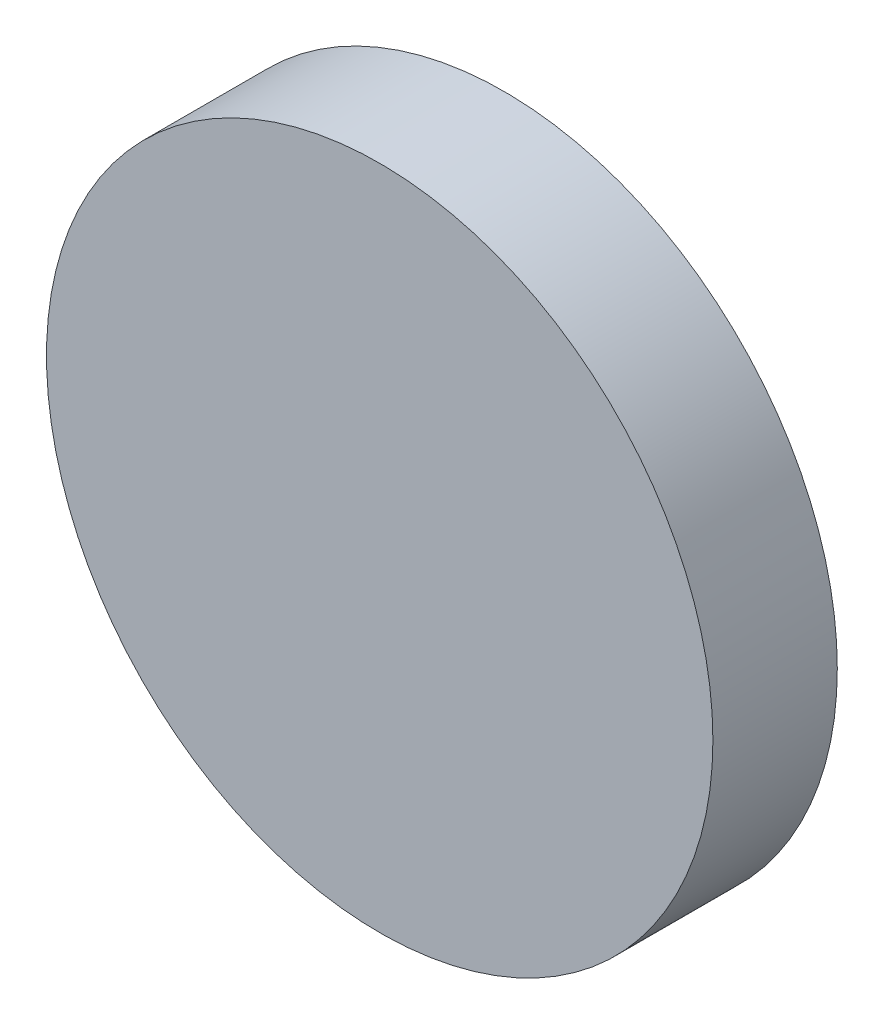
ISO-10303-21;
HEADER;
FILE_DESCRIPTION(('STEP AP214'),'2;1');
FILE_NAME('part.step','',(''),(''),'','','');
FILE_SCHEMA(('AUTOMOTIVE_DESIGN { 1 0 10303 214 1 1 1 1 }'));
ENDSEC;
DATA;
#1=APPLICATION_CONTEXT('core data for automotive mechanical design processes');
#2=APPLICATION_PROTOCOL_DEFINITION('international standard','automotive_design',2000,#1);
#3=PRODUCT_CONTEXT('',#1,'mechanical');
#4=PRODUCT('Part','Part','',(#3));
#5=PRODUCT_RELATED_PRODUCT_CATEGORY('part','',(#4));
#6=PRODUCT_DEFINITION_FORMATION('','',#4);
#7=PRODUCT_DEFINITION_CONTEXT('part definition',#1,'design');
#8=PRODUCT_DEFINITION('design','',#6,#7);
#9=PRODUCT_DEFINITION_SHAPE('','',#8);
#10=(LENGTH_UNIT() NAMED_UNIT(*) SI_UNIT(.MILLI.,.METRE.));
#11=(NAMED_UNIT(*) PLANE_ANGLE_UNIT() SI_UNIT($,.RADIAN.));
#12=(NAMED_UNIT(*) SI_UNIT($,.STERADIAN.) SOLID_ANGLE_UNIT());
#13=UNCERTAINTY_MEASURE_WITH_UNIT(LENGTH_MEASURE(1.E-05),#10,'distance_accuracy_value','');
#14=(GEOMETRIC_REPRESENTATION_CONTEXT(3) GLOBAL_UNCERTAINTY_ASSIGNED_CONTEXT((#13)) GLOBAL_UNIT_ASSIGNED_CONTEXT((#10,
#11,#12)) REPRESENTATION_CONTEXT('',''));
#15=CARTESIAN_POINT('',(0.,0.,0.));
#16=DIRECTION('',(0.,0.,1.));
#17=DIRECTION('',(1.,0.,0.));
#18=AXIS2_PLACEMENT_3D('',#15,#16,#17);
#19=CARTESIAN_POINT('',(50.,32.0273640967485,3.));
#20=DIRECTION('',(0.,0.,-1.));
#21=DIRECTION('',(-1.,0.,0.));
#22=AXIS2_PLACEMENT_3D('',#19,#20,#21);
#23=CYLINDRICAL_SURFACE('',#22,8.03510567732715);
#24=CARTESIAN_POINT('',(50.,32.0273640967485,3.));
#25=DIRECTION('',(0.,0.,1.));
#26=DIRECTION('',(1.,0.,0.));
#27=AXIS2_PLACEMENT_3D('',#24,#25,#26);
#28=CIRCLE('',#27,8.03510567732715);
#29=CARTESIAN_POINT('',(58.0351056773271,32.0273640967485,3.));
#30=VERTEX_POINT('',#29);
#31=EDGE_CURVE('E10',#30,#30,#28,.T.);
#32=ORIENTED_EDGE('',*,*,#31,.F.);
#33=EDGE_LOOP('',(#32));
#34=FACE_BOUND('',#33,.T.);
#35=CARTESIAN_POINT('',(50.,32.0273640967485,0.));
#36=DIRECTION('',(0.,0.,1.));
#37=DIRECTION('',(1.,0.,0.));
#38=AXIS2_PLACEMENT_3D('',#35,#36,#37);
#39=CIRCLE('',#38,8.03510567732715);
#40=CARTESIAN_POINT('',(58.0351056773271,32.0273640967485,0.));
#41=VERTEX_POINT('',#40);
#42=EDGE_CURVE('E34',#41,#41,#39,.T.);
#43=ORIENTED_EDGE('',*,*,#42,.T.);
#44=EDGE_LOOP('',(#43));
#45=FACE_BOUND('',#44,.T.);
#46=ADVANCED_FACE('F31',(#34,#45),#23,.T.);
#47=CARTESIAN_POINT('',(50.,32.0273640967485,3.));
#48=DIRECTION('',(0.,0.,1.));
#49=DIRECTION('',(1.,0.,0.));
#50=AXIS2_PLACEMENT_3D('',#47,#48,#49);
#51=PLANE('',#50);
#52=ORIENTED_EDGE('',*,*,#31,.T.);
#53=EDGE_LOOP('',(#52));
#54=FACE_BOUND('',#53,.T.);
#55=ADVANCED_FACE('F46',(#54),#51,.T.);
#56=CARTESIAN_POINT('',(50.,32.0273640967485,0.));
#57=DIRECTION('',(0.,0.,1.));
#58=DIRECTION('',(1.,0.,0.));
#59=AXIS2_PLACEMENT_3D('',#56,#57,#58);
#60=PLANE('',#59);
#61=ORIENTED_EDGE('',*,*,#42,.F.);
#62=EDGE_LOOP('',(#61));
#63=FACE_BOUND('',#62,.T.);
#64=ADVANCED_FACE('F44',(#63),#60,.F.);
#65=CLOSED_SHELL('',(#46,#55,#64));
#66=MANIFOLD_SOLID_BREP('B2',#65);
#67=ADVANCED_BREP_SHAPE_REPRESENTATION('',(#18,#66),#14);
#68=SHAPE_DEFINITION_REPRESENTATION(#9,#67);
ENDSEC;
END-ISO-10303-21;
